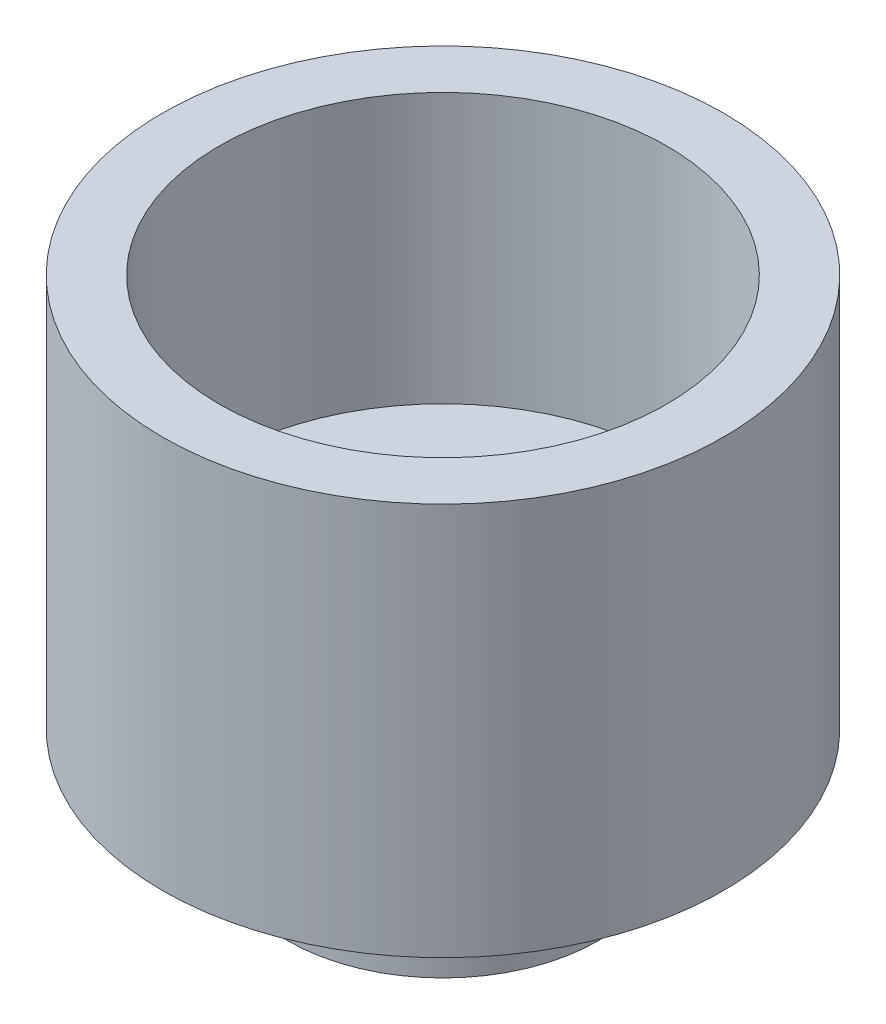
ISO-10303-21;
HEADER;
FILE_DESCRIPTION(('STEP AP214'),'2;1');
FILE_NAME('part.step','',(''),(''),'','','');
FILE_SCHEMA(('AUTOMOTIVE_DESIGN { 1 0 10303 214 1 1 1 1 }'));
ENDSEC;
DATA;
#1=APPLICATION_CONTEXT('core data for automotive mechanical design processes');
#2=APPLICATION_PROTOCOL_DEFINITION('international standard','automotive_design',2000,#1);
#3=PRODUCT_CONTEXT('',#1,'mechanical');
#4=PRODUCT('Part','Part','',(#3));
#5=PRODUCT_RELATED_PRODUCT_CATEGORY('part','',(#4));
#6=PRODUCT_DEFINITION_FORMATION('','',#4);
#7=PRODUCT_DEFINITION_CONTEXT('part definition',#1,'design');
#8=PRODUCT_DEFINITION('design','',#6,#7);
#9=PRODUCT_DEFINITION_SHAPE('','',#8);
#10=(LENGTH_UNIT() NAMED_UNIT(*) SI_UNIT(.MILLI.,.METRE.));
#11=(NAMED_UNIT(*) PLANE_ANGLE_UNIT() SI_UNIT($,.RADIAN.));
#12=(NAMED_UNIT(*) SI_UNIT($,.STERADIAN.) SOLID_ANGLE_UNIT());
#13=UNCERTAINTY_MEASURE_WITH_UNIT(LENGTH_MEASURE(1.E-05),#10,'distance_accuracy_value','');
#14=(GEOMETRIC_REPRESENTATION_CONTEXT(3) GLOBAL_UNCERTAINTY_ASSIGNED_CONTEXT((#13)) GLOBAL_UNIT_ASSIGNED_CONTEXT((#10,
#11,#12)) REPRESENTATION_CONTEXT('',''));
#15=CARTESIAN_POINT('',(0.,0.,0.));
#16=DIRECTION('',(0.,0.,1.));
#17=DIRECTION('',(1.,0.,0.));
#18=AXIS2_PLACEMENT_3D('',#15,#16,#17);
#19=CARTESIAN_POINT('',(0.,13.3,0.));
#20=DIRECTION('',(0.,-1.,0.));
#21=DIRECTION('',(0.,0.,-1.));
#22=AXIS2_PLACEMENT_3D('',#19,#20,#21);
#23=CYLINDRICAL_SURFACE('',#22,9.5);
#24=CARTESIAN_POINT('',(0.,13.3,0.));
#25=DIRECTION('',(0.,1.,0.));
#26=DIRECTION('',(0.,0.,1.));
#27=AXIS2_PLACEMENT_3D('',#24,#25,#26);
#28=CIRCLE('',#27,9.5);
#29=CARTESIAN_POINT('',(0.,13.3,9.5));
#30=VERTEX_POINT('',#29);
#31=EDGE_CURVE('E40',#30,#30,#28,.T.);
#32=ORIENTED_EDGE('',*,*,#31,.F.);
#33=EDGE_LOOP('',(#32));
#34=FACE_BOUND('',#33,.T.);
#35=CARTESIAN_POINT('',(0.,0.,0.));
#36=DIRECTION('',(0.,1.,0.));
#37=DIRECTION('',(0.,0.,1.));
#38=AXIS2_PLACEMENT_3D('',#35,#36,#37);
#39=CIRCLE('',#38,9.5);
#40=CARTESIAN_POINT('',(0.,0.,9.5));
#41=VERTEX_POINT('',#40);
#42=EDGE_CURVE('E45',#41,#41,#39,.T.);
#43=ORIENTED_EDGE('',*,*,#42,.T.);
#44=EDGE_LOOP('',(#43));
#45=FACE_BOUND('',#44,.T.);
#46=ADVANCED_FACE('F33',(#34,#45),#23,.T.);
#47=CARTESIAN_POINT('',(0.,13.3,0.));
#48=DIRECTION('',(0.,1.,0.));
#49=DIRECTION('',(0.,0.,1.));
#50=AXIS2_PLACEMENT_3D('',#47,#48,#49);
#51=PLANE('',#50);
#52=CARTESIAN_POINT('',(0.,13.3,0.));
#53=DIRECTION('',(0.,1.,0.));
#54=DIRECTION('',(0.,0.,1.));
#55=AXIS2_PLACEMENT_3D('',#52,#53,#54);
#56=CIRCLE('',#55,7.575);
#57=CARTESIAN_POINT('',(0.,13.3,7.575));
#58=VERTEX_POINT('',#57);
#59=EDGE_CURVE('E58',#58,#58,#56,.T.);
#60=ORIENTED_EDGE('',*,*,#59,.F.);
#61=EDGE_LOOP('',(#60));
#62=FACE_BOUND('',#61,.T.);
#63=ORIENTED_EDGE('',*,*,#31,.T.);
#64=EDGE_LOOP('',(#63));
#65=FACE_BOUND('',#64,.T.);
#66=ADVANCED_FACE('F86',(#62,#65),#51,.T.);
#67=CARTESIAN_POINT('',(0.,0.,0.));
#68=DIRECTION('',(0.,1.,0.));
#69=DIRECTION('',(0.,0.,1.));
#70=AXIS2_PLACEMENT_3D('',#67,#68,#69);
#71=PLANE('',#70);
#72=CARTESIAN_POINT('',(0.,0.,0.));
#73=DIRECTION('',(0.,-1.,0.));
#74=DIRECTION('',(0.,0.,-1.));
#75=AXIS2_PLACEMENT_3D('',#72,#73,#74);
#76=CIRCLE('',#75,5.25);
#77=CARTESIAN_POINT('',(0.,0.,-5.25));
#78=VERTEX_POINT('',#77);
#79=EDGE_CURVE('E10',#78,#78,#76,.T.);
#80=ORIENTED_EDGE('',*,*,#79,.F.);
#81=EDGE_LOOP('',(#80));
#82=FACE_BOUND('',#81,.T.);
#83=ORIENTED_EDGE('',*,*,#42,.F.);
#84=EDGE_LOOP('',(#83));
#85=FACE_BOUND('',#84,.T.);
#86=ADVANCED_FACE('F91',(#82,#85),#71,.F.);
#87=CARTESIAN_POINT('',(0.,-3.6,0.));
#88=DIRECTION('',(0.,1.,0.));
#89=DIRECTION('',(0.,0.,1.));
#90=AXIS2_PLACEMENT_3D('',#87,#88,#89);
#91=CYLINDRICAL_SURFACE('',#90,5.25);
#92=CARTESIAN_POINT('',(0.,-3.6,0.));
#93=DIRECTION('',(0.,-1.,0.));
#94=DIRECTION('',(0.,0.,-1.));
#95=AXIS2_PLACEMENT_3D('',#92,#93,#94);
#96=CIRCLE('',#95,5.25);
#97=CARTESIAN_POINT('',(0.,-3.6,-5.25));
#98=VERTEX_POINT('',#97);
#99=EDGE_CURVE('E48',#98,#98,#96,.T.);
#100=ORIENTED_EDGE('',*,*,#99,.F.);
#101=EDGE_LOOP('',(#100));
#102=FACE_BOUND('',#101,.T.);
#103=ORIENTED_EDGE('',*,*,#79,.T.);
#104=EDGE_LOOP('',(#103));
#105=FACE_BOUND('',#104,.T.);
#106=ADVANCED_FACE('F99',(#102,#105),#91,.T.);
#107=CARTESIAN_POINT('',(0.,-3.6,0.));
#108=DIRECTION('',(0.,-1.,0.));
#109=DIRECTION('',(0.,0.,-1.));
#110=AXIS2_PLACEMENT_3D('',#107,#108,#109);
#111=PLANE('',#110);
#112=CARTESIAN_POINT('',(0.,-3.6,0.));
#113=DIRECTION('',(0.,-1.,0.));
#114=DIRECTION('',(0.,0.,-1.));
#115=AXIS2_PLACEMENT_3D('',#112,#113,#114);
#116=CIRCLE('',#115,1.575);
#117=CARTESIAN_POINT('',(0.,-3.6,-1.575));
#118=VERTEX_POINT('',#117);
#119=EDGE_CURVE('E64',#118,#118,#116,.T.);
#120=ORIENTED_EDGE('',*,*,#119,.F.);
#121=EDGE_LOOP('',(#120));
#122=FACE_BOUND('',#121,.T.);
#123=ORIENTED_EDGE('',*,*,#99,.T.);
#124=EDGE_LOOP('',(#123));
#125=FACE_BOUND('',#124,.T.);
#126=ADVANCED_FACE('F82',(#122,#125),#111,.T.);
#127=CARTESIAN_POINT('',(0.,4.17,0.));
#128=DIRECTION('',(0.,1.,0.));
#129=DIRECTION('',(0.,0.,1.));
#130=AXIS2_PLACEMENT_3D('',#127,#128,#129);
#131=CYLINDRICAL_SURFACE('',#130,7.575);
#132=CARTESIAN_POINT('',(0.,4.17,0.));
#133=DIRECTION('',(0.,1.,0.));
#134=DIRECTION('',(0.,0.,1.));
#135=AXIS2_PLACEMENT_3D('',#132,#133,#134);
#136=CIRCLE('',#135,7.575);
#137=CARTESIAN_POINT('',(0.,4.17,7.575));
#138=VERTEX_POINT('',#137);
#139=EDGE_CURVE('E54',#138,#138,#136,.T.);
#140=ORIENTED_EDGE('',*,*,#139,.F.);
#141=EDGE_LOOP('',(#140));
#142=FACE_BOUND('',#141,.T.);
#143=ORIENTED_EDGE('',*,*,#59,.T.);
#144=EDGE_LOOP('',(#143));
#145=FACE_BOUND('',#144,.T.);
#146=ADVANCED_FACE('F75',(#142,#145),#131,.F.);
#147=CARTESIAN_POINT('',(0.,4.17,0.));
#148=DIRECTION('',(0.,1.,0.));
#149=DIRECTION('',(0.,0.,1.));
#150=AXIS2_PLACEMENT_3D('',#147,#148,#149);
#151=PLANE('',#150);
#152=CARTESIAN_POINT('',(0.,4.17,0.));
#153=DIRECTION('',(0.,1.,0.));
#154=DIRECTION('',(0.,0.,1.));
#155=AXIS2_PLACEMENT_3D('',#152,#153,#154);
#156=CIRCLE('',#155,1.575);
#157=CARTESIAN_POINT('',(0.,4.17,1.575));
#158=VERTEX_POINT('',#157);
#159=EDGE_CURVE('E36',#158,#158,#156,.T.);
#160=ORIENTED_EDGE('',*,*,#159,.F.);
#161=EDGE_LOOP('',(#160));
#162=FACE_BOUND('',#161,.T.);
#163=ORIENTED_EDGE('',*,*,#139,.T.);
#164=EDGE_LOOP('',(#163));
#165=FACE_BOUND('',#164,.T.);
#166=ADVANCED_FACE('F73',(#162,#165),#151,.T.);
#167=CARTESIAN_POINT('',(0.,5.53,0.));
#168=DIRECTION('',(0.,-1.,0.));
#169=DIRECTION('',(0.,0.,-1.));
#170=AXIS2_PLACEMENT_3D('',#167,#168,#169);
#171=CYLINDRICAL_SURFACE('',#170,1.575);
#172=ORIENTED_EDGE('',*,*,#159,.T.);
#173=EDGE_LOOP('',(#172));
#174=FACE_BOUND('',#173,.T.);
#175=ORIENTED_EDGE('',*,*,#119,.T.);
#176=EDGE_LOOP('',(#175));
#177=FACE_BOUND('',#176,.T.);
#178=ADVANCED_FACE('F71',(#174,#177),#171,.F.);
#179=CLOSED_SHELL('',(#46,#66,#86,#106,#126,#146,#166,#178));
#180=MANIFOLD_SOLID_BREP('B2',#179);
#181=ADVANCED_BREP_SHAPE_REPRESENTATION('',(#18,#180),#14);
#182=SHAPE_DEFINITION_REPRESENTATION(#9,#181);
ENDSEC;
END-ISO-10303-21;
